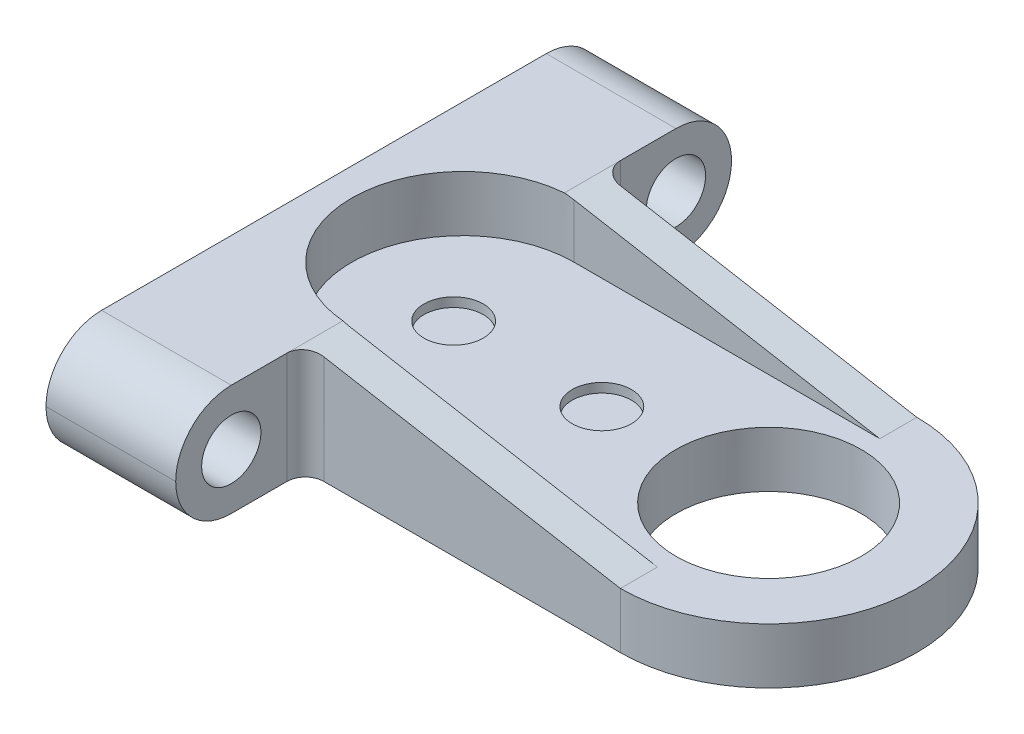
ISO-10303-21;
HEADER;
FILE_DESCRIPTION(('STEP AP214'),'2;1');
FILE_NAME('part.step','',(''),(''),'','','');
FILE_SCHEMA(('AUTOMOTIVE_DESIGN { 1 0 10303 214 1 1 1 1 }'));
ENDSEC;
DATA;
#1=APPLICATION_CONTEXT('core data for automotive mechanical design processes');
#2=APPLICATION_PROTOCOL_DEFINITION('international standard','automotive_design',2000,#1);
#3=PRODUCT_CONTEXT('',#1,'mechanical');
#4=PRODUCT('Part','Part','',(#3));
#5=PRODUCT_RELATED_PRODUCT_CATEGORY('part','',(#4));
#6=PRODUCT_DEFINITION_FORMATION('','',#4);
#7=PRODUCT_DEFINITION_CONTEXT('part definition',#1,'design');
#8=PRODUCT_DEFINITION('design','',#6,#7);
#9=PRODUCT_DEFINITION_SHAPE('','',#8);
#10=(LENGTH_UNIT() NAMED_UNIT(*) SI_UNIT(.MILLI.,.METRE.));
#11=(NAMED_UNIT(*) PLANE_ANGLE_UNIT() SI_UNIT($,.RADIAN.));
#12=(NAMED_UNIT(*) SI_UNIT($,.STERADIAN.) SOLID_ANGLE_UNIT());
#13=UNCERTAINTY_MEASURE_WITH_UNIT(LENGTH_MEASURE(1.E-05),#10,'distance_accuracy_value','');
#14=(GEOMETRIC_REPRESENTATION_CONTEXT(3) GLOBAL_UNCERTAINTY_ASSIGNED_CONTEXT((#13)) GLOBAL_UNIT_ASSIGNED_CONTEXT((#10,
#11,#12)) REPRESENTATION_CONTEXT('',''));
#15=CARTESIAN_POINT('',(0.,0.,0.));
#16=DIRECTION('',(0.,0.,1.));
#17=DIRECTION('',(1.,0.,0.));
#18=AXIS2_PLACEMENT_3D('',#15,#16,#17);
#19=CARTESIAN_POINT('',(-9.,0.,0.));
#20=DIRECTION('',(0.,1.,0.));
#21=DIRECTION('',(-1.,0.,0.));
#22=AXIS2_PLACEMENT_3D('',#19,#20,#21);
#23=CYLINDRICAL_SURFACE('',#22,1.6);
#24=CARTESIAN_POINT('',(-9.,3.,0.));
#25=DIRECTION('',(0.,1.,0.));
#26=DIRECTION('',(-1.,0.,0.));
#27=AXIS2_PLACEMENT_3D('',#24,#25,#26);
#28=CIRCLE('',#27,1.6);
#29=CARTESIAN_POINT('',(-10.6,3.,0.));
#30=VERTEX_POINT('',#29);
#31=EDGE_CURVE('E155',#30,#30,#28,.T.);
#32=CARTESIAN_POINT('',(-9.,2.5,0.));
#33=DIRECTION('',(0.,-1.,0.));
#34=DIRECTION('',(0.,0.,-1.));
#35=AXIS2_PLACEMENT_3D('',#32,#33,#34);
#36=CIRCLE('',#35,1.6);
#37=CARTESIAN_POINT('',(-10.6,2.5,0.));
#38=VERTEX_POINT('',#37);
#39=EDGE_CURVE('E11',#38,#38,#36,.F.);
#40=CARTESIAN_POINT('',(-10.6,3.,0.));
#41=CARTESIAN_POINT('',(-10.6,2.99479166666667,0.));
#42=CARTESIAN_POINT('',(-10.6,2.98958333333333,0.));
#43=CARTESIAN_POINT('',(-10.6,2.97916666666667,0.));
#44=CARTESIAN_POINT('',(-10.6,2.97395833333333,0.));
#45=CARTESIAN_POINT('',(-10.6,2.96354166666667,0.));
#46=CARTESIAN_POINT('',(-10.6,2.95833333333333,0.));
#47=CARTESIAN_POINT('',(-10.6,2.94791666666667,0.));
#48=CARTESIAN_POINT('',(-10.6,2.94270833333333,0.));
#49=CARTESIAN_POINT('',(-10.6,2.93229166666667,0.));
#50=CARTESIAN_POINT('',(-10.6,2.92708333333333,0.));
#51=CARTESIAN_POINT('',(-10.6,2.91666666666667,0.));
#52=CARTESIAN_POINT('',(-10.6,2.91145833333333,0.));
#53=CARTESIAN_POINT('',(-10.6,2.90104166666667,0.));
#54=CARTESIAN_POINT('',(-10.6,2.89583333333333,0.));
#55=CARTESIAN_POINT('',(-10.6,2.88541666666667,0.));
#56=CARTESIAN_POINT('',(-10.6,2.88020833333333,0.));
#57=CARTESIAN_POINT('',(-10.6,2.86979166666667,0.));
#58=CARTESIAN_POINT('',(-10.6,2.86458333333333,0.));
#59=CARTESIAN_POINT('',(-10.6,2.85416666666667,0.));
#60=CARTESIAN_POINT('',(-10.6,2.84895833333333,0.));
#61=CARTESIAN_POINT('',(-10.6,2.83854166666667,0.));
#62=CARTESIAN_POINT('',(-10.6,2.83333333333333,0.));
#63=CARTESIAN_POINT('',(-10.6,2.82291666666667,0.));
#64=CARTESIAN_POINT('',(-10.6,2.81770833333333,0.));
#65=CARTESIAN_POINT('',(-10.6,2.80729166666667,0.));
#66=CARTESIAN_POINT('',(-10.6,2.80208333333333,0.));
#67=CARTESIAN_POINT('',(-10.6,2.79166666666667,0.));
#68=CARTESIAN_POINT('',(-10.6,2.78645833333333,0.));
#69=CARTESIAN_POINT('',(-10.6,2.77604166666667,0.));
#70=CARTESIAN_POINT('',(-10.6,2.77083333333333,0.));
#71=CARTESIAN_POINT('',(-10.6,2.76041666666667,0.));
#72=CARTESIAN_POINT('',(-10.6,2.75520833333333,0.));
#73=CARTESIAN_POINT('',(-10.6,2.74479166666667,0.));
#74=CARTESIAN_POINT('',(-10.6,2.73958333333333,0.));
#75=CARTESIAN_POINT('',(-10.6,2.72916666666667,0.));
#76=CARTESIAN_POINT('',(-10.6,2.72395833333333,0.));
#77=CARTESIAN_POINT('',(-10.6,2.71354166666667,0.));
#78=CARTESIAN_POINT('',(-10.6,2.70833333333333,0.));
#79=CARTESIAN_POINT('',(-10.6,2.69791666666667,0.));
#80=CARTESIAN_POINT('',(-10.6,2.69270833333333,0.));
#81=CARTESIAN_POINT('',(-10.6,2.68229166666667,0.));
#82=CARTESIAN_POINT('',(-10.6,2.67708333333333,0.));
#83=CARTESIAN_POINT('',(-10.6,2.66666666666667,0.));
#84=CARTESIAN_POINT('',(-10.6,2.66145833333333,0.));
#85=CARTESIAN_POINT('',(-10.6,2.65104166666667,0.));
#86=CARTESIAN_POINT('',(-10.6,2.64583333333333,0.));
#87=CARTESIAN_POINT('',(-10.6,2.63541666666667,0.));
#88=CARTESIAN_POINT('',(-10.6,2.63020833333333,0.));
#89=CARTESIAN_POINT('',(-10.6,2.61979166666667,0.));
#90=CARTESIAN_POINT('',(-10.6,2.61458333333333,0.));
#91=CARTESIAN_POINT('',(-10.6,2.60416666666667,0.));
#92=CARTESIAN_POINT('',(-10.6,2.59895833333333,0.));
#93=CARTESIAN_POINT('',(-10.6,2.58854166666667,0.));
#94=CARTESIAN_POINT('',(-10.6,2.58333333333333,0.));
#95=CARTESIAN_POINT('',(-10.6,2.57291666666667,0.));
#96=CARTESIAN_POINT('',(-10.6,2.56770833333333,0.));
#97=CARTESIAN_POINT('',(-10.6,2.55729166666667,0.));
#98=CARTESIAN_POINT('',(-10.6,2.55208333333333,0.));
#99=CARTESIAN_POINT('',(-10.6,2.54166666666667,0.));
#100=CARTESIAN_POINT('',(-10.6,2.53645833333333,0.));
#101=CARTESIAN_POINT('',(-10.6,2.52604166666667,0.));
#102=CARTESIAN_POINT('',(-10.6,2.52083333333333,0.));
#103=CARTESIAN_POINT('',(-10.6,2.51041666666667,0.));
#104=CARTESIAN_POINT('',(-10.6,2.50520833333333,0.));
#105=CARTESIAN_POINT('',(-10.6,2.5,0.));
#106=B_SPLINE_CURVE_WITH_KNOTS('',3,(#40,#41,#42,#43,#44,#45,#46,#47,#48,#49,#50,#51,#52,#53,
#54,#55,#56,#57,#58,#59,#60,#61,#62,#63,#64,#65,#66,#67,#68,#69,#70,#71,#72,#73,#74,#75,#76,#77,
#78,#79,#80,#81,#82,#83,#84,#85,#86,#87,#88,#89,#90,#91,#92,#93,#94,#95,#96,#97,#98,#99,#100,
#101,#102,#103,#104,#105),.UNSPECIFIED.,.F.,.F.,(4,2,2,2,2,2,2,2,2,2,2,2,2,2,2,2,2,2,2,2,2,2,2,
2,2,2,2,2,2,2,2,2,4),(0.,0.015625,0.03125,0.0468749999999996,0.0624999999999996,
0.0781249999999996,0.0937499999999997,0.109375,0.124999999999999,0.140624999999999,
0.156249999999999,0.171874999999999,0.187499999999999,0.203124999999999,0.218749999999999,
0.234374999999999,0.249999999999999,0.265624999999999,0.281249999999999,0.296874999999999,
0.312499999999999,0.328124999999999,0.343749999999999,0.359374999999999,0.374999999999999,
0.390624999999998,0.406249999999998,0.421874999999998,0.437499999999998,0.453124999999998,
0.468749999999998,0.484374999999998,0.499999999999998),.UNSPECIFIED.);
#107=EDGE_CURVE('BSEAM35',#30,#38,#106,.T.);
#108=ORIENTED_EDGE('',*,*,#31,.T.);
#109=ORIENTED_EDGE('',*,*,#39,.F.);
#110=ORIENTED_EDGE('',*,*,#107,.T.);
#111=ORIENTED_EDGE('',*,*,#107,.F.);
#112=EDGE_LOOP('',(#108,#110,#109,#111));
#113=FACE_BOUND('',#112,.T.);
#114=ADVANCED_FACE('F35',(#113),#23,.F.);
#115=CARTESIAN_POINT('',(-17.,0.,0.));
#116=DIRECTION('',(0.,1.,0.));
#117=DIRECTION('',(-1.,0.,0.));
#118=AXIS2_PLACEMENT_3D('',#115,#116,#117);
#119=CYLINDRICAL_SURFACE('',#118,1.6);
#120=CARTESIAN_POINT('',(-17.,3.,0.));
#121=DIRECTION('',(0.,1.,0.));
#122=DIRECTION('',(-1.,0.,0.));
#123=AXIS2_PLACEMENT_3D('',#120,#121,#122);
#124=CIRCLE('',#123,1.6);
#125=CARTESIAN_POINT('',(-18.6,3.,0.));
#126=VERTEX_POINT('',#125);
#127=EDGE_CURVE('E439',#126,#126,#124,.T.);
#128=CARTESIAN_POINT('',(-17.,2.5,0.));
#129=DIRECTION('',(0.,-1.,0.));
#130=DIRECTION('',(0.,0.,-1.));
#131=AXIS2_PLACEMENT_3D('',#128,#129,#130);
#132=CIRCLE('',#131,1.6);
#133=CARTESIAN_POINT('',(-18.6,2.5,0.));
#134=VERTEX_POINT('',#133);
#135=EDGE_CURVE('E44',#134,#134,#132,.F.);
#136=CARTESIAN_POINT('',(-18.6,3.,0.));
#137=CARTESIAN_POINT('',(-18.6,2.99479166666666,0.));
#138=CARTESIAN_POINT('',(-18.6,2.98958333333333,0.));
#139=CARTESIAN_POINT('',(-18.6,2.97916666666666,0.));
#140=CARTESIAN_POINT('',(-18.6,2.97395833333333,0.));
#141=CARTESIAN_POINT('',(-18.6,2.96354166666666,0.));
#142=CARTESIAN_POINT('',(-18.6,2.95833333333333,0.));
#143=CARTESIAN_POINT('',(-18.6,2.94791666666666,0.));
#144=CARTESIAN_POINT('',(-18.6,2.94270833333333,0.));
#145=CARTESIAN_POINT('',(-18.6,2.93229166666666,0.));
#146=CARTESIAN_POINT('',(-18.6,2.92708333333333,0.));
#147=CARTESIAN_POINT('',(-18.6,2.91666666666666,0.));
#148=CARTESIAN_POINT('',(-18.6,2.91145833333333,0.));
#149=CARTESIAN_POINT('',(-18.6,2.90104166666667,0.));
#150=CARTESIAN_POINT('',(-18.6,2.89583333333333,0.));
#151=CARTESIAN_POINT('',(-18.6,2.88541666666667,0.));
#152=CARTESIAN_POINT('',(-18.6,2.88020833333333,0.));
#153=CARTESIAN_POINT('',(-18.6,2.86979166666667,0.));
#154=CARTESIAN_POINT('',(-18.6,2.86458333333333,0.));
#155=CARTESIAN_POINT('',(-18.6,2.85416666666667,0.));
#156=CARTESIAN_POINT('',(-18.6,2.84895833333333,0.));
#157=CARTESIAN_POINT('',(-18.6,2.83854166666667,0.));
#158=CARTESIAN_POINT('',(-18.6,2.83333333333333,0.));
#159=CARTESIAN_POINT('',(-18.6,2.82291666666667,0.));
#160=CARTESIAN_POINT('',(-18.6,2.81770833333333,0.));
#161=CARTESIAN_POINT('',(-18.6,2.80729166666667,0.));
#162=CARTESIAN_POINT('',(-18.6,2.80208333333333,0.));
#163=CARTESIAN_POINT('',(-18.6,2.79166666666667,0.));
#164=CARTESIAN_POINT('',(-18.6,2.78645833333333,0.));
#165=CARTESIAN_POINT('',(-18.6,2.77604166666667,0.));
#166=CARTESIAN_POINT('',(-18.6,2.77083333333333,0.));
#167=CARTESIAN_POINT('',(-18.6,2.76041666666667,0.));
#168=CARTESIAN_POINT('',(-18.6,2.75520833333333,0.));
#169=CARTESIAN_POINT('',(-18.6,2.74479166666667,0.));
#170=CARTESIAN_POINT('',(-18.6,2.73958333333333,0.));
#171=CARTESIAN_POINT('',(-18.6,2.72916666666667,0.));
#172=CARTESIAN_POINT('',(-18.6,2.72395833333333,0.));
#173=CARTESIAN_POINT('',(-18.6,2.71354166666667,0.));
#174=CARTESIAN_POINT('',(-18.6,2.70833333333333,0.));
#175=CARTESIAN_POINT('',(-18.6,2.69791666666667,0.));
#176=CARTESIAN_POINT('',(-18.6,2.69270833333333,0.));
#177=CARTESIAN_POINT('',(-18.6,2.68229166666667,0.));
#178=CARTESIAN_POINT('',(-18.6,2.67708333333333,0.));
#179=CARTESIAN_POINT('',(-18.6,2.66666666666667,0.));
#180=CARTESIAN_POINT('',(-18.6,2.66145833333333,0.));
#181=CARTESIAN_POINT('',(-18.6,2.65104166666667,0.));
#182=CARTESIAN_POINT('',(-18.6,2.64583333333333,0.));
#183=CARTESIAN_POINT('',(-18.6,2.63541666666667,0.));
#184=CARTESIAN_POINT('',(-18.6,2.63020833333333,0.));
#185=CARTESIAN_POINT('',(-18.6,2.61979166666667,0.));
#186=CARTESIAN_POINT('',(-18.6,2.61458333333333,0.));
#187=CARTESIAN_POINT('',(-18.6,2.60416666666667,0.));
#188=CARTESIAN_POINT('',(-18.6,2.59895833333333,0.));
#189=CARTESIAN_POINT('',(-18.6,2.58854166666667,0.));
#190=CARTESIAN_POINT('',(-18.6,2.58333333333333,0.));
#191=CARTESIAN_POINT('',(-18.6,2.57291666666667,0.));
#192=CARTESIAN_POINT('',(-18.6,2.56770833333333,0.));
#193=CARTESIAN_POINT('',(-18.6,2.55729166666667,0.));
#194=CARTESIAN_POINT('',(-18.6,2.55208333333333,0.));
#195=CARTESIAN_POINT('',(-18.6,2.54166666666667,0.));
#196=CARTESIAN_POINT('',(-18.6,2.53645833333333,0.));
#197=CARTESIAN_POINT('',(-18.6,2.52604166666667,0.));
#198=CARTESIAN_POINT('',(-18.6,2.52083333333333,0.));
#199=CARTESIAN_POINT('',(-18.6,2.51041666666667,0.));
#200=CARTESIAN_POINT('',(-18.6,2.50520833333333,0.));
#201=CARTESIAN_POINT('',(-18.6,2.5,0.));
#202=B_SPLINE_CURVE_WITH_KNOTS('',3,(#136,#137,#138,#139,#140,#141,#142,#143,#144,#145,#146,
#147,#148,#149,#150,#151,#152,#153,#154,#155,#156,#157,#158,#159,#160,#161,#162,#163,#164,#165,
#166,#167,#168,#169,#170,#171,#172,#173,#174,#175,#176,#177,#178,#179,#180,#181,#182,#183,#184,
#185,#186,#187,#188,#189,#190,#191,#192,#193,#194,#195,#196,#197,#198,#199,#200,#201),
.UNSPECIFIED.,.F.,.F.,(4,2,2,2,2,2,2,2,2,2,2,2,2,2,2,2,2,2,2,2,2,2,2,2,2,2,2,2,2,2,2,2,4),(0.,
0.015625,0.03125,0.0468749999999996,0.0624999999999996,0.0781249999999996,0.0937499999999992,
0.109374999999999,0.124999999999999,0.140624999999999,0.156249999999999,0.171874999999999,
0.187499999999999,0.203124999999999,0.218749999999998,0.234374999999998,0.249999999999999,
0.265624999999999,0.281249999999999,0.296874999999998,0.312499999999998,0.328124999999998,
0.343749999999998,0.359374999999998,0.374999999999998,0.390624999999998,0.406249999999998,
0.421874999999997,0.437499999999997,0.453124999999997,0.468749999999997,0.484374999999997,
0.499999999999997),.UNSPECIFIED.);
#203=EDGE_CURVE('BSEAM292',#126,#134,#202,.T.);
#204=ORIENTED_EDGE('',*,*,#127,.T.);
#205=ORIENTED_EDGE('',*,*,#135,.F.);
#206=ORIENTED_EDGE('',*,*,#203,.T.);
#207=ORIENTED_EDGE('',*,*,#203,.F.);
#208=EDGE_LOOP('',(#204,#206,#205,#207));
#209=FACE_BOUND('',#208,.T.);
#210=ADVANCED_FACE('F292',(#209),#119,.F.);
#211=CARTESIAN_POINT('',(0.,6.,0.));
#212=DIRECTION('',(0.,1.,0.));
#213=DIRECTION('',(0.,0.,1.));
#214=AXIS2_PLACEMENT_3D('',#211,#212,#213);
#215=PLANE('',#214);
#216=DIRECTION('',(0.,0.,1.));
#217=VECTOR('',#216,1.);
#218=CARTESIAN_POINT('',(-17.,6.,-15.));
#219=LINE('',#218,#217);
#220=CARTESIAN_POINT('',(-17.,6.,5.9791303715507));
#221=VERTEX_POINT('',#220);
#222=CARTESIAN_POINT('',(-17.,6.,9.));
#223=VERTEX_POINT('',#222);
#224=EDGE_CURVE('E173',#221,#223,#219,.T.);
#225=ORIENTED_EDGE('',*,*,#224,.F.);
#226=CARTESIAN_POINT('',(-16.5,6.,0.));
#227=DIRECTION('',(0.,1.,0.));
#228=DIRECTION('',(-1.,0.,0.));
#229=AXIS2_PLACEMENT_3D('',#226,#227,#228);
#230=CIRCLE('',#229,6.);
#231=CARTESIAN_POINT('',(-17.,6.,-5.9791303715507));
#232=VERTEX_POINT('',#231);
#233=EDGE_CURVE('E427',#232,#221,#230,.T.);
#234=ORIENTED_EDGE('',*,*,#233,.F.);
#235=CARTESIAN_POINT('',(-17.,6.,-9.00000000000001));
#236=VERTEX_POINT('',#235);
#237=EDGE_CURVE('E50',#236,#232,#219,.T.);
#238=ORIENTED_EDGE('',*,*,#237,.F.);
#239=DIRECTION('',(0.,0.,-1.));
#240=VECTOR('',#239,1.);
#241=CARTESIAN_POINT('',(-17.,6.,-15.));
#242=LINE('',#241,#240);
#243=CARTESIAN_POINT('',(-17.,6.,-12.));
#244=VERTEX_POINT('',#243);
#245=EDGE_CURVE('E205',#236,#244,#242,.T.);
#246=ORIENTED_EDGE('',*,*,#245,.T.);
#247=DIRECTION('',(-1.,0.,0.));
#248=VECTOR('',#247,1.);
#249=CARTESIAN_POINT('',(-24.,6.,-12.));
#250=LINE('',#249,#248);
#251=CARTESIAN_POINT('',(-24.,6.,-12.));
#252=VERTEX_POINT('',#251);
#253=EDGE_CURVE('E247',#244,#252,#250,.T.);
#254=ORIENTED_EDGE('',*,*,#253,.T.);
#255=DIRECTION('',(0.,0.,1.));
#256=VECTOR('',#255,1.);
#257=CARTESIAN_POINT('',(-24.,6.,-15.));
#258=LINE('',#257,#256);
#259=CARTESIAN_POINT('',(-24.,6.,12.));
#260=VERTEX_POINT('',#259);
#261=EDGE_CURVE('E198',#252,#260,#258,.T.);
#262=ORIENTED_EDGE('',*,*,#261,.T.);
#263=DIRECTION('',(1.,0.,0.));
#264=VECTOR('',#263,1.);
#265=CARTESIAN_POINT('',(-17.,6.,12.));
#266=LINE('',#265,#264);
#267=CARTESIAN_POINT('',(-17.,6.,12.));
#268=VERTEX_POINT('',#267);
#269=EDGE_CURVE('E245',#260,#268,#266,.T.);
#270=ORIENTED_EDGE('',*,*,#269,.T.);
#271=DIRECTION('',(0.,0.,-1.));
#272=VECTOR('',#271,1.);
#273=CARTESIAN_POINT('',(-17.,6.,8.));
#274=LINE('',#273,#272);
#275=EDGE_CURVE('E201',#268,#223,#274,.T.);
#276=ORIENTED_EDGE('',*,*,#275,.T.);
#277=EDGE_LOOP('',(#225,#234,#238,#246,#254,#262,#270,#276));
#278=FACE_BOUND('',#277,.T.);
#279=ADVANCED_FACE('F294',(#278),#215,.T.);
#280=CARTESIAN_POINT('',(0.,6.,0.));
#281=DIRECTION('',(0.,-1.,0.));
#282=DIRECTION('',(0.,0.,-1.));
#283=AXIS2_PLACEMENT_3D('',#280,#281,#282);
#284=CYLINDRICAL_SURFACE('',#283,5.);
#285=CARTESIAN_POINT('',(0.,0.,0.));
#286=DIRECTION('',(0.,1.,0.));
#287=DIRECTION('',(0.,0.,1.));
#288=AXIS2_PLACEMENT_3D('',#285,#286,#287);
#289=CIRCLE('',#288,5.);
#290=CARTESIAN_POINT('',(0.,0.,5.));
#291=VERTEX_POINT('',#290);
#292=EDGE_CURVE('E193',#291,#291,#289,.T.);
#293=ORIENTED_EDGE('',*,*,#292,.F.);
#294=EDGE_LOOP('',(#293));
#295=FACE_BOUND('',#294,.T.);
#296=CARTESIAN_POINT('',(0.,3.,0.));
#297=DIRECTION('',(0.,-1.,0.));
#298=DIRECTION('',(1.,0.,0.));
#299=AXIS2_PLACEMENT_3D('',#296,#297,#298);
#300=CIRCLE('',#299,5.);
#301=CARTESIAN_POINT('',(5.,3.,0.));
#302=VERTEX_POINT('',#301);
#303=EDGE_CURVE('E253',#302,#302,#300,.T.);
#304=ORIENTED_EDGE('',*,*,#303,.F.);
#305=EDGE_LOOP('',(#304));
#306=FACE_BOUND('',#305,.T.);
#307=ADVANCED_FACE('F301',(#295,#306),#284,.F.);
#308=CARTESIAN_POINT('',(0.,3.,-15.));
#309=DIRECTION('',(-0.173785333909048,-0.984783558817937,0.));
#310=DIRECTION('',(0.984783558817937,-0.173785333909048,0.));
#311=AXIS2_PLACEMENT_3D('',#308,#309,#310);
#312=PLANE('',#311);
#313=DIRECTION('',(-0.984783558817937,0.173785333909048,0.));
#314=VECTOR('',#313,1.);
#315=CARTESIAN_POINT('',(0.,3.,-6.));
#316=LINE('',#315,#314);
#317=CARTESIAN_POINT('',(0.,3.,-6.));
#318=VERTEX_POINT('',#317);
#319=CARTESIAN_POINT('',(-16.5,5.91176470588235,-6.));
#320=VERTEX_POINT('',#319);
#321=EDGE_CURVE('E147',#318,#320,#316,.T.);
#322=ORIENTED_EDGE('',*,*,#321,.F.);
#323=DIRECTION('',(0.,0.,1.));
#324=VECTOR('',#323,1.);
#325=CARTESIAN_POINT('',(0.,3.,-15.));
#326=LINE('',#325,#324);
#327=CARTESIAN_POINT('',(0.,3.,-8.));
#328=VERTEX_POINT('',#327);
#329=EDGE_CURVE('E162',#328,#318,#326,.T.);
#330=ORIENTED_EDGE('',*,*,#329,.F.);
#331=DIRECTION('',(0.984783558817937,-0.173785333909048,0.));
#332=VECTOR('',#331,1.);
#333=CARTESIAN_POINT('',(-0.513422818791947,3.09060402684564,-8.));
#334=LINE('',#333,#332);
#335=CARTESIAN_POINT('',(-16.,5.82352941176471,-8.));
#336=VERTEX_POINT('',#335);
#337=EDGE_CURVE('E179',#336,#328,#334,.T.);
#338=ORIENTED_EDGE('',*,*,#337,.F.);
#339=CARTESIAN_POINT('',(-16.,5.82352941176471,-9.));
#340=DIRECTION('',(-0.173785333909048,-0.984783558817937,0.));
#341=DIRECTION('',(-0.984783558817937,0.173785333909048,0.));
#342=AXIS2_PLACEMENT_3D('',#339,#340,#341);
#343=ELLIPSE('',#342,1.01545155891953,1.);
#344=EDGE_CURVE('E281',#336,#236,#343,.T.);
#345=ORIENTED_EDGE('',*,*,#344,.T.);
#346=ORIENTED_EDGE('',*,*,#237,.T.);
#347=CARTESIAN_POINT('',(-16.5,5.91176470588235,0.));
#348=DIRECTION('',(-0.173785333909048,-0.984783558817937,0.));
#349=DIRECTION('',(0.984783558817937,-0.173785333909048,0.));
#350=AXIS2_PLACEMENT_3D('',#347,#348,#349);
#351=ELLIPSE('',#350,6.0927093535172,6.);
#352=EDGE_CURVE('E164',#320,#232,#351,.F.);
#353=ORIENTED_EDGE('',*,*,#352,.F.);
#354=EDGE_LOOP('',(#322,#330,#338,#345,#346,#353));
#355=FACE_BOUND('',#354,.T.);
#356=ADVANCED_FACE('F160',(#355),#312,.F.);
#357=CARTESIAN_POINT('',(-16.5,5.91176470588235,6.));
#358=VERTEX_POINT('',#357);
#359=EDGE_CURVE('E267',#221,#358,#351,.F.);
#360=ORIENTED_EDGE('',*,*,#359,.F.);
#361=ORIENTED_EDGE('',*,*,#224,.T.);
#362=CARTESIAN_POINT('',(-16.,5.82352941176471,9.));
#363=DIRECTION('',(-0.173785333909048,-0.984783558817937,0.));
#364=DIRECTION('',(-0.984783558817937,0.173785333909048,0.));
#365=AXIS2_PLACEMENT_3D('',#362,#363,#364);
#366=ELLIPSE('',#365,1.01545155891953,1.);
#367=CARTESIAN_POINT('',(-16.,5.82352941176471,8.));
#368=VERTEX_POINT('',#367);
#369=EDGE_CURVE('E286',#223,#368,#366,.T.);
#370=ORIENTED_EDGE('',*,*,#369,.T.);
#371=DIRECTION('',(-0.984783558817937,0.173785333909048,0.));
#372=VECTOR('',#371,1.);
#373=CARTESIAN_POINT('',(-0.513422818791947,3.09060402684564,8.));
#374=LINE('',#373,#372);
#375=CARTESIAN_POINT('',(0.,3.,8.));
#376=VERTEX_POINT('',#375);
#377=EDGE_CURVE('E181',#376,#368,#374,.T.);
#378=ORIENTED_EDGE('',*,*,#377,.F.);
#379=CARTESIAN_POINT('',(0.,3.,6.));
#380=VERTEX_POINT('',#379);
#381=EDGE_CURVE('E174',#380,#376,#326,.T.);
#382=ORIENTED_EDGE('',*,*,#381,.F.);
#383=DIRECTION('',(0.984783558817937,-0.173785333909048,0.));
#384=VECTOR('',#383,1.);
#385=CARTESIAN_POINT('',(0.,3.,6.));
#386=LINE('',#385,#384);
#387=EDGE_CURVE('E265',#358,#380,#386,.T.);
#388=ORIENTED_EDGE('',*,*,#387,.F.);
#389=EDGE_LOOP('',(#360,#361,#370,#378,#382,#388));
#390=FACE_BOUND('',#389,.T.);
#391=ADVANCED_FACE('F327',(#390),#312,.F.);
#392=CARTESIAN_POINT('',(0.,0.,0.));
#393=DIRECTION('',(0.,1.,0.));
#394=DIRECTION('',(0.,0.,1.));
#395=AXIS2_PLACEMENT_3D('',#392,#393,#394);
#396=PLANE('',#395);
#397=CARTESIAN_POINT('',(-9.,0.,0.));
#398=DIRECTION('',(0.,-1.,0.));
#399=DIRECTION('',(0.,0.,-1.));
#400=AXIS2_PLACEMENT_3D('',#397,#398,#399);
#401=CIRCLE('',#400,3.);
#402=CARTESIAN_POINT('',(-9.,0.,-3.));
#403=VERTEX_POINT('',#402);
#404=EDGE_CURVE('E448',#403,#403,#401,.T.);
#405=ORIENTED_EDGE('',*,*,#404,.F.);
#406=EDGE_LOOP('',(#405));
#407=FACE_BOUND('',#406,.T.);
#408=CARTESIAN_POINT('',(-17.,0.,0.));
#409=DIRECTION('',(0.,-1.,0.));
#410=DIRECTION('',(0.,0.,-1.));
#411=AXIS2_PLACEMENT_3D('',#408,#409,#410);
#412=CIRCLE('',#411,3.);
#413=CARTESIAN_POINT('',(-17.,0.,-3.));
#414=VERTEX_POINT('',#413);
#415=EDGE_CURVE('E442',#414,#414,#412,.T.);
#416=ORIENTED_EDGE('',*,*,#415,.F.);
#417=EDGE_LOOP('',(#416));
#418=FACE_BOUND('',#417,.T.);
#419=DIRECTION('',(0.,0.,1.));
#420=VECTOR('',#419,1.);
#421=CARTESIAN_POINT('',(-24.,0.,-15.));
#422=LINE('',#421,#420);
#423=CARTESIAN_POINT('',(-24.,0.,-12.));
#424=VERTEX_POINT('',#423);
#425=CARTESIAN_POINT('',(-24.,0.,12.));
#426=VERTEX_POINT('',#425);
#427=EDGE_CURVE('E196',#424,#426,#422,.T.);
#428=ORIENTED_EDGE('',*,*,#427,.F.);
#429=DIRECTION('',(-1.,0.,0.));
#430=VECTOR('',#429,1.);
#431=CARTESIAN_POINT('',(0.,0.,-12.));
#432=LINE('',#431,#430);
#433=CARTESIAN_POINT('',(-17.,0.,-12.));
#434=VERTEX_POINT('',#433);
#435=EDGE_CURVE('E237',#424,#434,#432,.F.);
#436=ORIENTED_EDGE('',*,*,#435,.T.);
#437=DIRECTION('',(0.,0.,-1.));
#438=VECTOR('',#437,1.);
#439=CARTESIAN_POINT('',(-17.,0.,-15.));
#440=LINE('',#439,#438);
#441=CARTESIAN_POINT('',(-17.,0.,-9.00000000000001));
#442=VERTEX_POINT('',#441);
#443=EDGE_CURVE('E202',#442,#434,#440,.T.);
#444=ORIENTED_EDGE('',*,*,#443,.F.);
#445=CARTESIAN_POINT('',(-16.,0.,-9.));
#446=DIRECTION('',(0.,1.,0.));
#447=DIRECTION('',(0.,0.,1.));
#448=AXIS2_PLACEMENT_3D('',#445,#446,#447);
#449=CIRCLE('',#448,1.);
#450=CARTESIAN_POINT('',(-16.,0.,-8.));
#451=VERTEX_POINT('',#450);
#452=EDGE_CURVE('E279',#442,#451,#449,.T.);
#453=ORIENTED_EDGE('',*,*,#452,.T.);
#454=DIRECTION('',(-1.,0.,0.));
#455=VECTOR('',#454,1.);
#456=CARTESIAN_POINT('',(0.,0.,-8.));
#457=LINE('',#456,#455);
#458=CARTESIAN_POINT('',(0.,0.,-8.));
#459=VERTEX_POINT('',#458);
#460=EDGE_CURVE('E218',#459,#451,#457,.T.);
#461=ORIENTED_EDGE('',*,*,#460,.F.);
#462=CARTESIAN_POINT('',(0.,0.,0.));
#463=DIRECTION('',(0.,1.,0.));
#464=DIRECTION('',(0.,0.,1.));
#465=AXIS2_PLACEMENT_3D('',#462,#463,#464);
#466=CIRCLE('',#465,8.);
#467=CARTESIAN_POINT('',(0.,0.,8.));
#468=VERTEX_POINT('',#467);
#469=EDGE_CURVE('E215',#468,#459,#466,.T.);
#470=ORIENTED_EDGE('',*,*,#469,.F.);
#471=DIRECTION('',(1.,0.,0.));
#472=VECTOR('',#471,1.);
#473=CARTESIAN_POINT('',(0.,0.,8.));
#474=LINE('',#473,#472);
#475=CARTESIAN_POINT('',(-16.,0.,8.));
#476=VERTEX_POINT('',#475);
#477=EDGE_CURVE('E213',#476,#468,#474,.T.);
#478=ORIENTED_EDGE('',*,*,#477,.F.);
#479=CARTESIAN_POINT('',(-16.,0.,9.));
#480=DIRECTION('',(0.,1.,0.));
#481=DIRECTION('',(0.,0.,1.));
#482=AXIS2_PLACEMENT_3D('',#479,#480,#481);
#483=CIRCLE('',#482,1.);
#484=CARTESIAN_POINT('',(-17.,0.,9.));
#485=VERTEX_POINT('',#484);
#486=EDGE_CURVE('E284',#476,#485,#483,.T.);
#487=ORIENTED_EDGE('',*,*,#486,.T.);
#488=DIRECTION('',(0.,0.,-1.));
#489=VECTOR('',#488,1.);
#490=CARTESIAN_POINT('',(-17.,0.,8.));
#491=LINE('',#490,#489);
#492=CARTESIAN_POINT('',(-17.,0.,12.));
#493=VERTEX_POINT('',#492);
#494=EDGE_CURVE('E210',#493,#485,#491,.T.);
#495=ORIENTED_EDGE('',*,*,#494,.F.);
#496=DIRECTION('',(1.,0.,0.));
#497=VECTOR('',#496,1.);
#498=CARTESIAN_POINT('',(0.,0.,12.));
#499=LINE('',#498,#497);
#500=EDGE_CURVE('E234',#493,#426,#499,.F.);
#501=ORIENTED_EDGE('',*,*,#500,.T.);
#502=EDGE_LOOP('',(#428,#436,#444,#453,#461,#470,#478,#487,#495,#501));
#503=FACE_BOUND('',#502,.T.);
#504=ORIENTED_EDGE('',*,*,#292,.T.);
#505=EDGE_LOOP('',(#504));
#506=FACE_BOUND('',#505,.T.);
#507=ADVANCED_FACE('F339',(#407,#418,#503,#506),#396,.F.);
#508=CARTESIAN_POINT('',(-24.,6.,-15.));
#509=DIRECTION('',(1.,0.,0.));
#510=DIRECTION('',(0.,0.,-1.));
#511=AXIS2_PLACEMENT_3D('',#508,#509,#510);
#512=PLANE('',#511);
#513=CARTESIAN_POINT('',(-24.,3.,12.));
#514=DIRECTION('',(-1.,0.,0.));
#515=DIRECTION('',(0.,0.,1.));
#516=AXIS2_PLACEMENT_3D('',#513,#514,#515);
#517=CIRCLE('',#516,1.6);
#518=CARTESIAN_POINT('',(-24.,3.,13.6));
#519=VERTEX_POINT('',#518);
#520=EDGE_CURVE('E185',#519,#519,#517,.T.);
#521=ORIENTED_EDGE('',*,*,#520,.F.);
#522=EDGE_LOOP('',(#521));
#523=FACE_BOUND('',#522,.T.);
#524=CARTESIAN_POINT('',(-24.,3.,-12.));
#525=DIRECTION('',(-1.,0.,0.));
#526=DIRECTION('',(0.,0.,1.));
#527=AXIS2_PLACEMENT_3D('',#524,#525,#526);
#528=CIRCLE('',#527,1.6);
#529=CARTESIAN_POINT('',(-24.,3.,-10.4));
#530=VERTEX_POINT('',#529);
#531=EDGE_CURVE('E189',#530,#530,#528,.T.);
#532=ORIENTED_EDGE('',*,*,#531,.F.);
#533=EDGE_LOOP('',(#532));
#534=FACE_BOUND('',#533,.T.);
#535=CARTESIAN_POINT('',(-24.,3.,-12.));
#536=DIRECTION('',(1.,0.,0.));
#537=DIRECTION('',(0.,0.,-1.));
#538=AXIS2_PLACEMENT_3D('',#535,#536,#537);
#539=CIRCLE('',#538,3.);
#540=CARTESIAN_POINT('',(-24.,3.,-15.));
#541=VERTEX_POINT('',#540);
#542=EDGE_CURVE('E230',#252,#541,#539,.F.);
#543=ORIENTED_EDGE('',*,*,#542,.T.);
#544=CARTESIAN_POINT('',(-24.,3.,-12.));
#545=DIRECTION('',(1.,0.,0.));
#546=DIRECTION('',(0.,0.,-1.));
#547=AXIS2_PLACEMENT_3D('',#544,#545,#546);
#548=CIRCLE('',#547,3.);
#549=EDGE_CURVE('E232',#541,#424,#548,.F.);
#550=ORIENTED_EDGE('',*,*,#549,.T.);
#551=ORIENTED_EDGE('',*,*,#427,.T.);
#552=CARTESIAN_POINT('',(-24.,3.,12.));
#553=DIRECTION('',(1.,0.,0.));
#554=DIRECTION('',(0.,0.,-1.));
#555=AXIS2_PLACEMENT_3D('',#552,#553,#554);
#556=CIRCLE('',#555,3.);
#557=CARTESIAN_POINT('',(-24.,3.,15.));
#558=VERTEX_POINT('',#557);
#559=EDGE_CURVE('E228',#426,#558,#556,.F.);
#560=ORIENTED_EDGE('',*,*,#559,.T.);
#561=CARTESIAN_POINT('',(-24.,3.,12.));
#562=DIRECTION('',(1.,0.,0.));
#563=DIRECTION('',(0.,0.,-1.));
#564=AXIS2_PLACEMENT_3D('',#561,#562,#563);
#565=CIRCLE('',#564,3.);
#566=EDGE_CURVE('E226',#558,#260,#565,.F.);
#567=ORIENTED_EDGE('',*,*,#566,.T.);
#568=ORIENTED_EDGE('',*,*,#261,.F.);
#569=EDGE_LOOP('',(#543,#550,#551,#560,#567,#568));
#570=FACE_BOUND('',#569,.T.);
#571=ADVANCED_FACE('F342',(#523,#534,#570),#512,.F.);
#572=CARTESIAN_POINT('',(-17.,6.,8.));
#573=DIRECTION('',(-1.,0.,0.));
#574=DIRECTION('',(0.,0.,1.));
#575=AXIS2_PLACEMENT_3D('',#572,#573,#574);
#576=PLANE('',#575);
#577=CARTESIAN_POINT('',(-17.,3.,12.));
#578=DIRECTION('',(-1.,0.,0.));
#579=DIRECTION('',(0.,0.,1.));
#580=AXIS2_PLACEMENT_3D('',#577,#578,#579);
#581=CIRCLE('',#580,1.6);
#582=CARTESIAN_POINT('',(-17.,3.,13.6));
#583=VERTEX_POINT('',#582);
#584=EDGE_CURVE('E188',#583,#583,#581,.T.);
#585=ORIENTED_EDGE('',*,*,#584,.T.);
#586=EDGE_LOOP('',(#585));
#587=FACE_BOUND('',#586,.T.);
#588=ORIENTED_EDGE('',*,*,#494,.T.);
#589=DIRECTION('',(0.,-1.,0.));
#590=VECTOR('',#589,1.);
#591=CARTESIAN_POINT('',(-17.,6.,9.));
#592=LINE('',#591,#590);
#593=EDGE_CURVE('E276',#485,#223,#592,.F.);
#594=ORIENTED_EDGE('',*,*,#593,.T.);
#595=ORIENTED_EDGE('',*,*,#275,.F.);
#596=CARTESIAN_POINT('',(-17.,3.,12.));
#597=DIRECTION('',(-1.,0.,0.));
#598=DIRECTION('',(0.,0.,1.));
#599=AXIS2_PLACEMENT_3D('',#596,#597,#598);
#600=CIRCLE('',#599,3.);
#601=CARTESIAN_POINT('',(-17.,3.,15.));
#602=VERTEX_POINT('',#601);
#603=EDGE_CURVE('E249',#268,#602,#600,.F.);
#604=ORIENTED_EDGE('',*,*,#603,.T.);
#605=CARTESIAN_POINT('',(-17.,3.,12.));
#606=DIRECTION('',(-1.,0.,0.));
#607=DIRECTION('',(0.,0.,1.));
#608=AXIS2_PLACEMENT_3D('',#605,#606,#607);
#609=CIRCLE('',#608,3.);
#610=EDGE_CURVE('E251',#602,#493,#609,.F.);
#611=ORIENTED_EDGE('',*,*,#610,.T.);
#612=EDGE_LOOP('',(#588,#594,#595,#604,#611));
#613=FACE_BOUND('',#612,.T.);
#614=ADVANCED_FACE('F360',(#587,#613),#576,.F.);
#615=CARTESIAN_POINT('',(0.,6.,8.));
#616=DIRECTION('',(0.,0.,-1.));
#617=DIRECTION('',(-1.,0.,0.));
#618=AXIS2_PLACEMENT_3D('',#615,#616,#617);
#619=PLANE('',#618);
#620=ORIENTED_EDGE('',*,*,#377,.T.);
#621=DIRECTION('',(0.,-1.,0.));
#622=VECTOR('',#621,1.);
#623=CARTESIAN_POINT('',(-16.,0.,8.));
#624=LINE('',#623,#622);
#625=EDGE_CURVE('E273',#368,#476,#624,.T.);
#626=ORIENTED_EDGE('',*,*,#625,.T.);
#627=ORIENTED_EDGE('',*,*,#477,.T.);
#628=DIRECTION('',(0.,-1.,0.));
#629=VECTOR('',#628,1.);
#630=CARTESIAN_POINT('',(0.,6.,8.));
#631=LINE('',#630,#629);
#632=EDGE_CURVE('E223',#376,#468,#631,.T.);
#633=ORIENTED_EDGE('',*,*,#632,.F.);
#634=EDGE_LOOP('',(#620,#626,#627,#633));
#635=FACE_BOUND('',#634,.T.);
#636=ADVANCED_FACE('F356',(#635),#619,.F.);
#637=CARTESIAN_POINT('',(0.,6.,0.));
#638=DIRECTION('',(0.,-1.,0.));
#639=DIRECTION('',(0.,0.,-1.));
#640=AXIS2_PLACEMENT_3D('',#637,#638,#639);
#641=CYLINDRICAL_SURFACE('',#640,8.);
#642=CARTESIAN_POINT('',(0.,3.,0.));
#643=DIRECTION('',(0.,-1.,0.));
#644=DIRECTION('',(1.,0.,0.));
#645=AXIS2_PLACEMENT_3D('',#642,#643,#644);
#646=CIRCLE('',#645,8.);
#647=EDGE_CURVE('E171',#328,#376,#646,.T.);
#648=ORIENTED_EDGE('',*,*,#647,.T.);
#649=ORIENTED_EDGE('',*,*,#632,.T.);
#650=ORIENTED_EDGE('',*,*,#469,.T.);
#651=DIRECTION('',(0.,-1.,0.));
#652=VECTOR('',#651,1.);
#653=CARTESIAN_POINT('',(0.,6.,-8.));
#654=LINE('',#653,#652);
#655=EDGE_CURVE('E207',#328,#459,#654,.T.);
#656=ORIENTED_EDGE('',*,*,#655,.F.);
#657=EDGE_LOOP('',(#648,#649,#650,#656));
#658=FACE_BOUND('',#657,.T.);
#659=ADVANCED_FACE('F352',(#658),#641,.T.);
#660=CARTESIAN_POINT('',(0.,6.,-8.));
#661=DIRECTION('',(0.,0.,1.));
#662=DIRECTION('',(1.,0.,0.));
#663=AXIS2_PLACEMENT_3D('',#660,#661,#662);
#664=PLANE('',#663);
#665=ORIENTED_EDGE('',*,*,#460,.T.);
#666=DIRECTION('',(0.,-1.,0.));
#667=VECTOR('',#666,1.);
#668=CARTESIAN_POINT('',(-16.,6.,-8.));
#669=LINE('',#668,#667);
#670=EDGE_CURVE('E271',#451,#336,#669,.F.);
#671=ORIENTED_EDGE('',*,*,#670,.T.);
#672=ORIENTED_EDGE('',*,*,#337,.T.);
#673=ORIENTED_EDGE('',*,*,#655,.T.);
#674=EDGE_LOOP('',(#665,#671,#672,#673));
#675=FACE_BOUND('',#674,.T.);
#676=ADVANCED_FACE('F348',(#675),#664,.F.);
#677=CARTESIAN_POINT('',(-17.,6.,-15.));
#678=DIRECTION('',(-1.,0.,0.));
#679=DIRECTION('',(0.,0.,1.));
#680=AXIS2_PLACEMENT_3D('',#677,#678,#679);
#681=PLANE('',#680);
#682=CARTESIAN_POINT('',(-17.,3.,-12.));
#683=DIRECTION('',(-1.,0.,0.));
#684=DIRECTION('',(0.,0.,1.));
#685=AXIS2_PLACEMENT_3D('',#682,#683,#684);
#686=CIRCLE('',#685,1.6);
#687=CARTESIAN_POINT('',(-17.,3.,-10.4));
#688=VERTEX_POINT('',#687);
#689=EDGE_CURVE('E192',#688,#688,#686,.T.);
#690=ORIENTED_EDGE('',*,*,#689,.T.);
#691=EDGE_LOOP('',(#690));
#692=FACE_BOUND('',#691,.T.);
#693=ORIENTED_EDGE('',*,*,#245,.F.);
#694=DIRECTION('',(0.,-1.,0.));
#695=VECTOR('',#694,1.);
#696=CARTESIAN_POINT('',(-17.,0.,-9.));
#697=LINE('',#696,#695);
#698=EDGE_CURVE('E165',#236,#442,#697,.T.);
#699=ORIENTED_EDGE('',*,*,#698,.T.);
#700=ORIENTED_EDGE('',*,*,#443,.T.);
#701=CARTESIAN_POINT('',(-17.,3.,-12.));
#702=DIRECTION('',(-1.,0.,0.));
#703=DIRECTION('',(0.,0.,1.));
#704=AXIS2_PLACEMENT_3D('',#701,#702,#703);
#705=CIRCLE('',#704,3.);
#706=CARTESIAN_POINT('',(-17.,3.,-15.));
#707=VERTEX_POINT('',#706);
#708=EDGE_CURVE('E243',#434,#707,#705,.F.);
#709=ORIENTED_EDGE('',*,*,#708,.T.);
#710=CARTESIAN_POINT('',(-17.,3.,-12.));
#711=DIRECTION('',(-1.,0.,0.));
#712=DIRECTION('',(0.,0.,1.));
#713=AXIS2_PLACEMENT_3D('',#710,#711,#712);
#714=CIRCLE('',#713,3.);
#715=EDGE_CURVE('E240',#707,#244,#714,.F.);
#716=ORIENTED_EDGE('',*,*,#715,.T.);
#717=EDGE_LOOP('',(#693,#699,#700,#709,#716));
#718=FACE_BOUND('',#717,.T.);
#719=ADVANCED_FACE('F344',(#692,#718),#681,.F.);
#720=CARTESIAN_POINT('',(0.,3.,-12.));
#721=DIRECTION('',(1.,0.,0.));
#722=DIRECTION('',(0.,0.,-1.));
#723=AXIS2_PLACEMENT_3D('',#720,#721,#722);
#724=CYLINDRICAL_SURFACE('',#723,3.);
#725=ORIENTED_EDGE('',*,*,#253,.F.);
#726=ORIENTED_EDGE('',*,*,#715,.F.);
#727=DIRECTION('',(-1.,0.,0.));
#728=VECTOR('',#727,1.);
#729=CARTESIAN_POINT('',(-17.,3.,-15.));
#730=LINE('',#729,#728);
#731=EDGE_CURVE('E197',#541,#707,#730,.F.);
#732=ORIENTED_EDGE('',*,*,#731,.F.);
#733=ORIENTED_EDGE('',*,*,#542,.F.);
#734=EDGE_LOOP('',(#725,#726,#732,#733));
#735=FACE_BOUND('',#734,.T.);
#736=ADVANCED_FACE('F347',(#735),#724,.T.);
#737=CARTESIAN_POINT('',(-24.,3.,-12.));
#738=DIRECTION('',(-1.,0.,0.));
#739=DIRECTION('',(0.,0.,1.));
#740=AXIS2_PLACEMENT_3D('',#737,#738,#739);
#741=CYLINDRICAL_SURFACE('',#740,3.);
#742=ORIENTED_EDGE('',*,*,#708,.F.);
#743=ORIENTED_EDGE('',*,*,#435,.F.);
#744=ORIENTED_EDGE('',*,*,#549,.F.);
#745=ORIENTED_EDGE('',*,*,#731,.T.);
#746=EDGE_LOOP('',(#742,#743,#744,#745));
#747=FACE_BOUND('',#746,.T.);
#748=ADVANCED_FACE('F368',(#747),#741,.T.);
#749=CARTESIAN_POINT('',(0.,3.,12.));
#750=DIRECTION('',(-1.,0.,0.));
#751=DIRECTION('',(0.,0.,1.));
#752=AXIS2_PLACEMENT_3D('',#749,#750,#751);
#753=CYLINDRICAL_SURFACE('',#752,3.);
#754=ORIENTED_EDGE('',*,*,#269,.F.);
#755=ORIENTED_EDGE('',*,*,#566,.F.);
#756=DIRECTION('',(1.,0.,0.));
#757=VECTOR('',#756,1.);
#758=CARTESIAN_POINT('',(-24.,3.,15.));
#759=LINE('',#758,#757);
#760=EDGE_CURVE('E256',#602,#558,#759,.F.);
#761=ORIENTED_EDGE('',*,*,#760,.F.);
#762=ORIENTED_EDGE('',*,*,#603,.F.);
#763=EDGE_LOOP('',(#754,#755,#761,#762));
#764=FACE_BOUND('',#763,.T.);
#765=ADVANCED_FACE('F371',(#764),#753,.T.);
#766=CARTESIAN_POINT('',(-24.,3.,12.));
#767=DIRECTION('',(1.,0.,0.));
#768=DIRECTION('',(0.,0.,-1.));
#769=AXIS2_PLACEMENT_3D('',#766,#767,#768);
#770=CYLINDRICAL_SURFACE('',#769,3.);
#771=ORIENTED_EDGE('',*,*,#559,.F.);
#772=ORIENTED_EDGE('',*,*,#500,.F.);
#773=ORIENTED_EDGE('',*,*,#610,.F.);
#774=ORIENTED_EDGE('',*,*,#760,.T.);
#775=EDGE_LOOP('',(#771,#772,#773,#774));
#776=FACE_BOUND('',#775,.T.);
#777=ADVANCED_FACE('F334',(#776),#770,.T.);
#778=CARTESIAN_POINT('',(8.,3.,-12.));
#779=DIRECTION('',(-1.,0.,0.));
#780=DIRECTION('',(0.,0.,1.));
#781=AXIS2_PLACEMENT_3D('',#778,#779,#780);
#782=CYLINDRICAL_SURFACE('',#781,1.6);
#783=ORIENTED_EDGE('',*,*,#531,.T.);
#784=EDGE_LOOP('',(#783));
#785=FACE_BOUND('',#784,.T.);
#786=ORIENTED_EDGE('',*,*,#689,.F.);
#787=EDGE_LOOP('',(#786));
#788=FACE_BOUND('',#787,.T.);
#789=ADVANCED_FACE('F330',(#785,#788),#782,.F.);
#790=CARTESIAN_POINT('',(8.,3.,12.));
#791=DIRECTION('',(-1.,0.,0.));
#792=DIRECTION('',(0.,0.,1.));
#793=AXIS2_PLACEMENT_3D('',#790,#791,#792);
#794=CYLINDRICAL_SURFACE('',#793,1.6);
#795=ORIENTED_EDGE('',*,*,#520,.T.);
#796=EDGE_LOOP('',(#795));
#797=FACE_BOUND('',#796,.T.);
#798=ORIENTED_EDGE('',*,*,#584,.F.);
#799=EDGE_LOOP('',(#798));
#800=FACE_BOUND('',#799,.T.);
#801=ADVANCED_FACE('F323',(#797,#800),#794,.F.);
#802=CARTESIAN_POINT('',(8.,3.,-15.));
#803=DIRECTION('',(0.,-1.,0.));
#804=DIRECTION('',(1.,0.,0.));
#805=AXIS2_PLACEMENT_3D('',#802,#803,#804);
#806=PLANE('',#805);
#807=ORIENTED_EDGE('',*,*,#127,.F.);
#808=EDGE_LOOP('',(#807));
#809=FACE_BOUND('',#808,.T.);
#810=ORIENTED_EDGE('',*,*,#31,.F.);
#811=EDGE_LOOP('',(#810));
#812=FACE_BOUND('',#811,.T.);
#813=DIRECTION('',(1.,0.,0.));
#814=VECTOR('',#813,1.);
#815=CARTESIAN_POINT('',(0.,3.,6.));
#816=LINE('',#815,#814);
#817=CARTESIAN_POINT('',(-16.5,3.,6.));
#818=VERTEX_POINT('',#817);
#819=EDGE_CURVE('E429',#818,#380,#816,.T.);
#820=ORIENTED_EDGE('',*,*,#819,.T.);
#821=ORIENTED_EDGE('',*,*,#381,.T.);
#822=ORIENTED_EDGE('',*,*,#647,.F.);
#823=ORIENTED_EDGE('',*,*,#329,.T.);
#824=DIRECTION('',(-1.,0.,0.));
#825=VECTOR('',#824,1.);
#826=CARTESIAN_POINT('',(0.,3.,-6.));
#827=LINE('',#826,#825);
#828=CARTESIAN_POINT('',(-16.5,3.,-6.));
#829=VERTEX_POINT('',#828);
#830=EDGE_CURVE('E144',#318,#829,#827,.T.);
#831=ORIENTED_EDGE('',*,*,#830,.T.);
#832=CARTESIAN_POINT('',(-16.5,3.,0.));
#833=DIRECTION('',(0.,1.,0.));
#834=DIRECTION('',(-1.,0.,0.));
#835=AXIS2_PLACEMENT_3D('',#832,#833,#834);
#836=CIRCLE('',#835,6.);
#837=EDGE_CURVE('E154',#829,#818,#836,.T.);
#838=ORIENTED_EDGE('',*,*,#837,.T.);
#839=EDGE_LOOP('',(#820,#821,#822,#823,#831,#838));
#840=FACE_BOUND('',#839,.T.);
#841=ORIENTED_EDGE('',*,*,#303,.T.);
#842=EDGE_LOOP('',(#841));
#843=FACE_BOUND('',#842,.T.);
#844=ADVANCED_FACE('F168',(#809,#812,#840,#843),#806,.F.);
#845=CARTESIAN_POINT('',(0.,6.,-6.));
#846=DIRECTION('',(0.,0.,1.));
#847=DIRECTION('',(1.,0.,0.));
#848=AXIS2_PLACEMENT_3D('',#845,#846,#847);
#849=PLANE('',#848);
#850=ORIENTED_EDGE('',*,*,#321,.T.);
#851=DIRECTION('',(0.,-1.,0.));
#852=VECTOR('',#851,1.);
#853=CARTESIAN_POINT('',(-16.5,6.,-6.));
#854=LINE('',#853,#852);
#855=EDGE_CURVE('E149',#320,#829,#854,.T.);
#856=ORIENTED_EDGE('',*,*,#855,.T.);
#857=ORIENTED_EDGE('',*,*,#830,.F.);
#858=EDGE_LOOP('',(#850,#856,#857));
#859=FACE_BOUND('',#858,.T.);
#860=ADVANCED_FACE('F146',(#859),#849,.T.);
#861=CARTESIAN_POINT('',(-16.5,6.,0.));
#862=DIRECTION('',(0.,-1.,0.));
#863=DIRECTION('',(1.,0.,0.));
#864=AXIS2_PLACEMENT_3D('',#861,#862,#863);
#865=CYLINDRICAL_SURFACE('',#864,6.);
#866=ORIENTED_EDGE('',*,*,#352,.T.);
#867=ORIENTED_EDGE('',*,*,#233,.T.);
#868=ORIENTED_EDGE('',*,*,#359,.T.);
#869=DIRECTION('',(0.,-1.,0.));
#870=VECTOR('',#869,1.);
#871=CARTESIAN_POINT('',(-16.5,6.,6.));
#872=LINE('',#871,#870);
#873=EDGE_CURVE('E428',#358,#818,#872,.T.);
#874=ORIENTED_EDGE('',*,*,#873,.T.);
#875=ORIENTED_EDGE('',*,*,#837,.F.);
#876=ORIENTED_EDGE('',*,*,#855,.F.);
#877=EDGE_LOOP('',(#866,#867,#868,#874,#875,#876));
#878=FACE_BOUND('',#877,.T.);
#879=ADVANCED_FACE('F314',(#878),#865,.F.);
#880=CARTESIAN_POINT('',(0.,6.,6.));
#881=DIRECTION('',(0.,0.,-1.));
#882=DIRECTION('',(-1.,0.,0.));
#883=AXIS2_PLACEMENT_3D('',#880,#881,#882);
#884=PLANE('',#883);
#885=ORIENTED_EDGE('',*,*,#387,.T.);
#886=ORIENTED_EDGE('',*,*,#819,.F.);
#887=ORIENTED_EDGE('',*,*,#873,.F.);
#888=EDGE_LOOP('',(#885,#886,#887));
#889=FACE_BOUND('',#888,.T.);
#890=ADVANCED_FACE('F310',(#889),#884,.T.);
#891=CARTESIAN_POINT('',(-16.,6.,-9.));
#892=DIRECTION('',(0.,1.,0.));
#893=DIRECTION('',(0.,0.,1.));
#894=AXIS2_PLACEMENT_3D('',#891,#892,#893);
#895=CYLINDRICAL_SURFACE('',#894,1.);
#896=ORIENTED_EDGE('',*,*,#344,.F.);
#897=ORIENTED_EDGE('',*,*,#670,.F.);
#898=ORIENTED_EDGE('',*,*,#452,.F.);
#899=ORIENTED_EDGE('',*,*,#698,.F.);
#900=EDGE_LOOP('',(#896,#897,#898,#899));
#901=FACE_BOUND('',#900,.T.);
#902=ADVANCED_FACE('F313',(#901),#895,.F.);
#903=CARTESIAN_POINT('',(-16.,6.,9.));
#904=DIRECTION('',(0.,1.,0.));
#905=DIRECTION('',(0.,0.,1.));
#906=AXIS2_PLACEMENT_3D('',#903,#904,#905);
#907=CYLINDRICAL_SURFACE('',#906,1.);
#908=ORIENTED_EDGE('',*,*,#369,.F.);
#909=ORIENTED_EDGE('',*,*,#593,.F.);
#910=ORIENTED_EDGE('',*,*,#486,.F.);
#911=ORIENTED_EDGE('',*,*,#625,.F.);
#912=EDGE_LOOP('',(#908,#909,#910,#911));
#913=FACE_BOUND('',#912,.T.);
#914=ADVANCED_FACE('F37',(#913),#907,.F.);
#915=CARTESIAN_POINT('',(-17.,2.,0.));
#916=DIRECTION('',(0.,-1.,0.));
#917=DIRECTION('',(0.,0.,-1.));
#918=AXIS2_PLACEMENT_3D('',#915,#916,#917);
#919=PLANE('',#918);
#920=CARTESIAN_POINT('',(-17.,2.,0.));
#921=DIRECTION('',(0.,-1.,0.));
#922=DIRECTION('',(0.,0.,-1.));
#923=AXIS2_PLACEMENT_3D('',#920,#921,#922);
#924=CIRCLE('',#923,3.);
#925=CARTESIAN_POINT('',(-17.,2.,-3.));
#926=VERTEX_POINT('',#925);
#927=EDGE_CURVE('E441',#926,#926,#924,.T.);
#928=ORIENTED_EDGE('',*,*,#927,.T.);
#929=EDGE_LOOP('',(#928));
#930=FACE_BOUND('',#929,.T.);
#931=ADVANCED_FACE('F386',(#930),#919,.T.);
#932=CARTESIAN_POINT('',(-17.,2.,0.));
#933=DIRECTION('',(0.,-1.,0.));
#934=DIRECTION('',(0.,0.,-1.));
#935=AXIS2_PLACEMENT_3D('',#932,#933,#934);
#936=CYLINDRICAL_SURFACE('',#935,3.);
#937=ORIENTED_EDGE('',*,*,#927,.F.);
#938=EDGE_LOOP('',(#937));
#939=FACE_BOUND('',#938,.T.);
#940=ORIENTED_EDGE('',*,*,#415,.T.);
#941=EDGE_LOOP('',(#940));
#942=FACE_BOUND('',#941,.T.);
#943=ADVANCED_FACE('F307',(#939,#942),#936,.F.);
#944=CARTESIAN_POINT('',(-9.,2.,0.));
#945=DIRECTION('',(0.,-1.,0.));
#946=DIRECTION('',(0.,0.,-1.));
#947=AXIS2_PLACEMENT_3D('',#944,#945,#946);
#948=PLANE('',#947);
#949=CARTESIAN_POINT('',(-9.,2.,0.));
#950=DIRECTION('',(0.,-1.,0.));
#951=DIRECTION('',(0.,0.,-1.));
#952=AXIS2_PLACEMENT_3D('',#949,#950,#951);
#953=CIRCLE('',#952,3.);
#954=CARTESIAN_POINT('',(-9.,2.,-3.));
#955=VERTEX_POINT('',#954);
#956=EDGE_CURVE('E445',#955,#955,#953,.T.);
#957=ORIENTED_EDGE('',*,*,#956,.T.);
#958=EDGE_LOOP('',(#957));
#959=FACE_BOUND('',#958,.T.);
#960=ADVANCED_FACE('F454',(#959),#948,.T.);
#961=CARTESIAN_POINT('',(-9.,2.,0.));
#962=DIRECTION('',(0.,-1.,0.));
#963=DIRECTION('',(0.,0.,-1.));
#964=AXIS2_PLACEMENT_3D('',#961,#962,#963);
#965=CYLINDRICAL_SURFACE('',#964,3.);
#966=ORIENTED_EDGE('',*,*,#956,.F.);
#967=EDGE_LOOP('',(#966));
#968=FACE_BOUND('',#967,.T.);
#969=ORIENTED_EDGE('',*,*,#404,.T.);
#970=EDGE_LOOP('',(#969));
#971=FACE_BOUND('',#970,.T.);
#972=ADVANCED_FACE('F456',(#968,#971),#965,.F.);
#973=CARTESIAN_POINT('',(-17.,2.5,0.));
#974=DIRECTION('',(0.,-1.,0.));
#975=DIRECTION('',(0.,0.,-1.));
#976=AXIS2_PLACEMENT_3D('',#973,#974,#975);
#977=PLANE('',#976);
#978=ORIENTED_EDGE('',*,*,#135,.T.);
#979=EDGE_LOOP('',(#978));
#980=FACE_BOUND('',#979,.T.);
#981=ADVANCED_FACE('F290',(#980),#977,.F.);
#982=CARTESIAN_POINT('',(-9.,2.5,0.));
#983=DIRECTION('',(0.,-1.,0.));
#984=DIRECTION('',(0.,0.,-1.));
#985=AXIS2_PLACEMENT_3D('',#982,#983,#984);
#986=PLANE('',#985);
#987=ORIENTED_EDGE('',*,*,#39,.T.);
#988=EDGE_LOOP('',(#987));
#989=FACE_BOUND('',#988,.T.);
#990=ADVANCED_FACE('F478',(#989),#986,.F.);
#991=CLOSED_SHELL('',(#114,#210,#279,#307,#356,#391,#507,#571,#614,#636,#659,#676,#719,#736,
#748,#765,#777,#789,#801,#844,#860,#879,#890,#902,#914,#931,#943,#960,#972,#981,#990));
#992=MANIFOLD_SOLID_BREP('B2',#991);
#993=ADVANCED_BREP_SHAPE_REPRESENTATION('',(#18,#992),#14);
#994=SHAPE_DEFINITION_REPRESENTATION(#9,#993);
ENDSEC;
END-ISO-10303-21;
